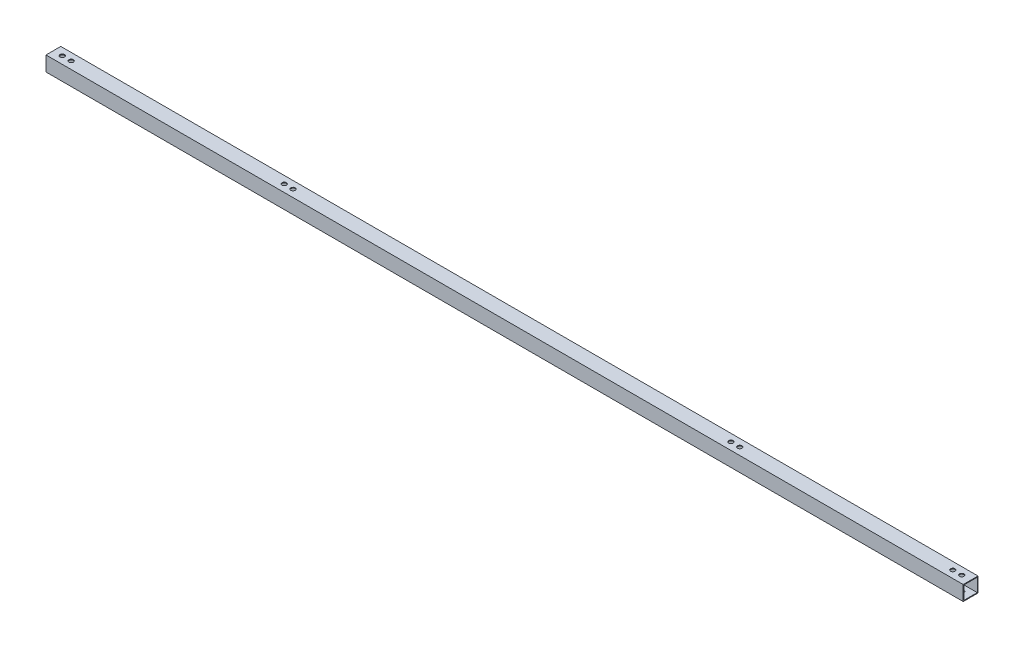
ISO-10303-21;
HEADER;
FILE_DESCRIPTION(('STEP AP214'),'2;1');
FILE_NAME('part.step','',(''),(''),'','','');
FILE_SCHEMA(('AUTOMOTIVE_DESIGN { 1 0 10303 214 1 1 1 1 }'));
ENDSEC;
DATA;
#1=APPLICATION_CONTEXT('core data for automotive mechanical design processes');
#2=APPLICATION_PROTOCOL_DEFINITION('international standard','automotive_design',2000,#1);
#3=PRODUCT_CONTEXT('',#1,'mechanical');
#4=PRODUCT('Part','Part','',(#3));
#5=PRODUCT_RELATED_PRODUCT_CATEGORY('part','',(#4));
#6=PRODUCT_DEFINITION_FORMATION('','',#4);
#7=PRODUCT_DEFINITION_CONTEXT('part definition',#1,'design');
#8=PRODUCT_DEFINITION('design','',#6,#7);
#9=PRODUCT_DEFINITION_SHAPE('','',#8);
#10=(LENGTH_UNIT() NAMED_UNIT(*) SI_UNIT(.MILLI.,.METRE.));
#11=(NAMED_UNIT(*) PLANE_ANGLE_UNIT() SI_UNIT($,.RADIAN.));
#12=(NAMED_UNIT(*) SI_UNIT($,.STERADIAN.) SOLID_ANGLE_UNIT());
#13=UNCERTAINTY_MEASURE_WITH_UNIT(LENGTH_MEASURE(1.E-05),#10,'distance_accuracy_value','');
#14=(GEOMETRIC_REPRESENTATION_CONTEXT(3) GLOBAL_UNCERTAINTY_ASSIGNED_CONTEXT((#13)) GLOBAL_UNIT_ASSIGNED_CONTEXT((#10,
#11,#12)) REPRESENTATION_CONTEXT('',''));
#15=CARTESIAN_POINT('',(0.,0.,0.));
#16=DIRECTION('',(0.,0.,1.));
#17=DIRECTION('',(1.,0.,0.));
#18=AXIS2_PLACEMENT_3D('',#15,#16,#17);
#19=CARTESIAN_POINT('',(1240.,0.,0.));
#20=DIRECTION('',(-1.,0.,0.));
#21=DIRECTION('',(0.,0.,1.));
#22=AXIS2_PLACEMENT_3D('',#19,#20,#21);
#23=PLANE('',#22);
#24=DIRECTION('',(0.,1.,0.));
#25=VECTOR('',#24,1.);
#26=CARTESIAN_POINT('',(1240.,-10.,-10.));
#27=LINE('',#26,#25);
#28=CARTESIAN_POINT('',(1240.,-10.,-10.));
#29=VERTEX_POINT('',#28);
#30=CARTESIAN_POINT('',(1240.,10.,-10.));
#31=VERTEX_POINT('',#30);
#32=EDGE_CURVE('E157',#29,#31,#27,.T.);
#33=ORIENTED_EDGE('',*,*,#32,.T.);
#34=DIRECTION('',(0.,0.,1.));
#35=VECTOR('',#34,1.);
#36=CARTESIAN_POINT('',(1240.,10.,10.));
#37=LINE('',#36,#35);
#38=CARTESIAN_POINT('',(1240.,10.,10.));
#39=VERTEX_POINT('',#38);
#40=EDGE_CURVE('E161',#31,#39,#37,.T.);
#41=ORIENTED_EDGE('',*,*,#40,.T.);
#42=DIRECTION('',(0.,-1.,0.));
#43=VECTOR('',#42,1.);
#44=CARTESIAN_POINT('',(1240.,-10.,10.));
#45=LINE('',#44,#43);
#46=CARTESIAN_POINT('',(1240.,-10.,10.));
#47=VERTEX_POINT('',#46);
#48=EDGE_CURVE('E165',#39,#47,#45,.T.);
#49=ORIENTED_EDGE('',*,*,#48,.T.);
#50=DIRECTION('',(0.,0.,-1.));
#51=VECTOR('',#50,1.);
#52=CARTESIAN_POINT('',(1240.,-10.,10.));
#53=LINE('',#52,#51);
#54=EDGE_CURVE('E168',#47,#29,#53,.T.);
#55=ORIENTED_EDGE('',*,*,#54,.T.);
#56=EDGE_LOOP('',(#33,#41,#49,#55));
#57=FACE_BOUND('',#56,.T.);
#58=DIRECTION('',(0.,-1.,0.));
#59=VECTOR('',#58,1.);
#60=CARTESIAN_POINT('',(1240.,-9.,9.));
#61=LINE('',#60,#59);
#62=CARTESIAN_POINT('',(1240.,9.,9.));
#63=VERTEX_POINT('',#62);
#64=CARTESIAN_POINT('',(1240.,-9.,9.));
#65=VERTEX_POINT('',#64);
#66=EDGE_CURVE('E107',#63,#65,#61,.T.);
#67=ORIENTED_EDGE('',*,*,#66,.F.);
#68=DIRECTION('',(0.,0.,1.));
#69=VECTOR('',#68,1.);
#70=CARTESIAN_POINT('',(1240.,9.,9.));
#71=LINE('',#70,#69);
#72=CARTESIAN_POINT('',(1240.,9.,-9.));
#73=VERTEX_POINT('',#72);
#74=EDGE_CURVE('E133',#73,#63,#71,.T.);
#75=ORIENTED_EDGE('',*,*,#74,.F.);
#76=DIRECTION('',(0.,1.,0.));
#77=VECTOR('',#76,1.);
#78=CARTESIAN_POINT('',(1240.,-9.,-9.));
#79=LINE('',#78,#77);
#80=CARTESIAN_POINT('',(1240.,-9.,-9.));
#81=VERTEX_POINT('',#80);
#82=EDGE_CURVE('E129',#81,#73,#79,.T.);
#83=ORIENTED_EDGE('',*,*,#82,.F.);
#84=DIRECTION('',(0.,0.,-1.));
#85=VECTOR('',#84,1.);
#86=CARTESIAN_POINT('',(1240.,-9.,9.));
#87=LINE('',#86,#85);
#88=EDGE_CURVE('E116',#65,#81,#87,.T.);
#89=ORIENTED_EDGE('',*,*,#88,.F.);
#90=EDGE_LOOP('',(#67,#75,#83,#89));
#91=FACE_BOUND('',#90,.T.);
#92=ADVANCED_FACE('F39',(#57,#91),#23,.F.);
#93=CARTESIAN_POINT('',(0.,0.,0.));
#94=DIRECTION('',(-1.,0.,0.));
#95=DIRECTION('',(0.,0.,1.));
#96=AXIS2_PLACEMENT_3D('',#93,#94,#95);
#97=PLANE('',#96);
#98=DIRECTION('',(0.,1.,0.));
#99=VECTOR('',#98,1.);
#100=CARTESIAN_POINT('',(0.,-10.,-10.));
#101=LINE('',#100,#99);
#102=CARTESIAN_POINT('',(0.,-10.,-10.));
#103=VERTEX_POINT('',#102);
#104=CARTESIAN_POINT('',(0.,10.,-10.));
#105=VERTEX_POINT('',#104);
#106=EDGE_CURVE('E125',#103,#105,#101,.T.);
#107=ORIENTED_EDGE('',*,*,#106,.F.);
#108=DIRECTION('',(0.,0.,-1.));
#109=VECTOR('',#108,1.);
#110=CARTESIAN_POINT('',(0.,-10.,10.));
#111=LINE('',#110,#109);
#112=CARTESIAN_POINT('',(0.,-10.,10.));
#113=VERTEX_POINT('',#112);
#114=EDGE_CURVE('E162',#113,#103,#111,.T.);
#115=ORIENTED_EDGE('',*,*,#114,.F.);
#116=DIRECTION('',(0.,-1.,0.));
#117=VECTOR('',#116,1.);
#118=CARTESIAN_POINT('',(0.,-10.,10.));
#119=LINE('',#118,#117);
#120=CARTESIAN_POINT('',(0.,10.,10.));
#121=VERTEX_POINT('',#120);
#122=EDGE_CURVE('E178',#121,#113,#119,.T.);
#123=ORIENTED_EDGE('',*,*,#122,.F.);
#124=DIRECTION('',(0.,0.,1.));
#125=VECTOR('',#124,1.);
#126=CARTESIAN_POINT('',(0.,10.,10.));
#127=LINE('',#126,#125);
#128=EDGE_CURVE('E175',#105,#121,#127,.T.);
#129=ORIENTED_EDGE('',*,*,#128,.F.);
#130=EDGE_LOOP('',(#107,#115,#123,#129));
#131=FACE_BOUND('',#130,.T.);
#132=DIRECTION('',(0.,0.,1.));
#133=VECTOR('',#132,1.);
#134=CARTESIAN_POINT('',(0.,9.,9.));
#135=LINE('',#134,#133);
#136=CARTESIAN_POINT('',(0.,9.,-9.));
#137=VERTEX_POINT('',#136);
#138=CARTESIAN_POINT('',(0.,9.,9.));
#139=VERTEX_POINT('',#138);
#140=EDGE_CURVE('E117',#137,#139,#135,.T.);
#141=ORIENTED_EDGE('',*,*,#140,.T.);
#142=DIRECTION('',(0.,-1.,0.));
#143=VECTOR('',#142,1.);
#144=CARTESIAN_POINT('',(0.,-9.,9.));
#145=LINE('',#144,#143);
#146=CARTESIAN_POINT('',(0.,-9.,9.));
#147=VERTEX_POINT('',#146);
#148=EDGE_CURVE('E65',#139,#147,#145,.T.);
#149=ORIENTED_EDGE('',*,*,#148,.T.);
#150=DIRECTION('',(0.,0.,-1.));
#151=VECTOR('',#150,1.);
#152=CARTESIAN_POINT('',(0.,-9.,9.));
#153=LINE('',#152,#151);
#154=CARTESIAN_POINT('',(0.,-9.,-9.));
#155=VERTEX_POINT('',#154);
#156=EDGE_CURVE('E123',#147,#155,#153,.T.);
#157=ORIENTED_EDGE('',*,*,#156,.T.);
#158=DIRECTION('',(0.,1.,0.));
#159=VECTOR('',#158,1.);
#160=CARTESIAN_POINT('',(0.,-9.,-9.));
#161=LINE('',#160,#159);
#162=EDGE_CURVE('E144',#155,#137,#161,.T.);
#163=ORIENTED_EDGE('',*,*,#162,.T.);
#164=EDGE_LOOP('',(#141,#149,#157,#163));
#165=FACE_BOUND('',#164,.T.);
#166=ADVANCED_FACE('F280',(#131,#165),#97,.T.);
#167=CARTESIAN_POINT('',(1240.,-10.,-10.));
#168=DIRECTION('',(0.,0.,1.));
#169=DIRECTION('',(1.,0.,0.));
#170=AXIS2_PLACEMENT_3D('',#167,#168,#169);
#171=PLANE('',#170);
#172=ORIENTED_EDGE('',*,*,#106,.T.);
#173=DIRECTION('',(-1.,0.,0.));
#174=VECTOR('',#173,1.);
#175=CARTESIAN_POINT('',(1240.,10.,-10.));
#176=LINE('',#175,#174);
#177=EDGE_CURVE('E11',#31,#105,#176,.T.);
#178=ORIENTED_EDGE('',*,*,#177,.F.);
#179=ORIENTED_EDGE('',*,*,#32,.F.);
#180=DIRECTION('',(-1.,0.,0.));
#181=VECTOR('',#180,1.);
#182=CARTESIAN_POINT('',(1240.,-10.,-10.));
#183=LINE('',#182,#181);
#184=EDGE_CURVE('E171',#29,#103,#183,.T.);
#185=ORIENTED_EDGE('',*,*,#184,.T.);
#186=EDGE_LOOP('',(#172,#178,#179,#185));
#187=FACE_BOUND('',#186,.T.);
#188=ADVANCED_FACE('F41',(#187),#171,.F.);
#189=CARTESIAN_POINT('',(1240.,10.,10.));
#190=DIRECTION('',(0.,-1.,0.));
#191=DIRECTION('',(0.,0.,-1.));
#192=AXIS2_PLACEMENT_3D('',#189,#190,#191);
#193=PLANE('',#192);
#194=CARTESIAN_POINT('',(12.,10.,0.));
#195=DIRECTION('',(0.,1.,0.));
#196=DIRECTION('',(0.,0.,1.));
#197=AXIS2_PLACEMENT_3D('',#194,#195,#196);
#198=CIRCLE('',#197,3.);
#199=CARTESIAN_POINT('',(12.,10.,3.));
#200=VERTEX_POINT('',#199);
#201=EDGE_CURVE('E198',#200,#200,#198,.T.);
#202=ORIENTED_EDGE('',*,*,#201,.F.);
#203=EDGE_LOOP('',(#202));
#204=FACE_BOUND('',#203,.T.);
#205=CARTESIAN_POINT('',(928.,10.,0.));
#206=DIRECTION('',(0.,1.,0.));
#207=DIRECTION('',(0.,0.,-1.));
#208=AXIS2_PLACEMENT_3D('',#205,#206,#207);
#209=CIRCLE('',#208,2.99999999999994);
#210=CARTESIAN_POINT('',(928.,10.,-2.99999999999994));
#211=VERTEX_POINT('',#210);
#212=EDGE_CURVE('E309',#211,#211,#209,.T.);
#213=ORIENTED_EDGE('',*,*,#212,.F.);
#214=EDGE_LOOP('',(#213));
#215=FACE_BOUND('',#214,.T.);
#216=CARTESIAN_POINT('',(916.,10.,0.));
#217=DIRECTION('',(0.,1.,0.));
#218=DIRECTION('',(0.,0.,-1.));
#219=AXIS2_PLACEMENT_3D('',#216,#217,#218);
#220=CIRCLE('',#219,2.99999999999994);
#221=CARTESIAN_POINT('',(916.,10.,-2.99999999999994));
#222=VERTEX_POINT('',#221);
#223=EDGE_CURVE('E313',#222,#222,#220,.T.);
#224=ORIENTED_EDGE('',*,*,#223,.F.);
#225=EDGE_LOOP('',(#224));
#226=FACE_BOUND('',#225,.T.);
#227=CARTESIAN_POINT('',(324.,10.,0.));
#228=DIRECTION('',(0.,1.,0.));
#229=DIRECTION('',(0.,0.,1.));
#230=AXIS2_PLACEMENT_3D('',#227,#228,#229);
#231=CIRCLE('',#230,2.99999999999999);
#232=CARTESIAN_POINT('',(324.,10.,2.99999999999999));
#233=VERTEX_POINT('',#232);
#234=EDGE_CURVE('E317',#233,#233,#231,.T.);
#235=ORIENTED_EDGE('',*,*,#234,.F.);
#236=EDGE_LOOP('',(#235));
#237=FACE_BOUND('',#236,.T.);
#238=CARTESIAN_POINT('',(24.,10.,0.));
#239=DIRECTION('',(0.,1.,0.));
#240=DIRECTION('',(0.,0.,1.));
#241=AXIS2_PLACEMENT_3D('',#238,#239,#240);
#242=CIRCLE('',#241,3.);
#243=CARTESIAN_POINT('',(24.,10.,3.));
#244=VERTEX_POINT('',#243);
#245=EDGE_CURVE('E321',#244,#244,#242,.T.);
#246=ORIENTED_EDGE('',*,*,#245,.F.);
#247=EDGE_LOOP('',(#246));
#248=FACE_BOUND('',#247,.T.);
#249=CARTESIAN_POINT('',(1216.,10.,0.));
#250=DIRECTION('',(0.,1.,0.));
#251=DIRECTION('',(0.,0.,-1.));
#252=AXIS2_PLACEMENT_3D('',#249,#250,#251);
#253=CIRCLE('',#252,2.99999999999994);
#254=CARTESIAN_POINT('',(1216.,10.,-2.99999999999994));
#255=VERTEX_POINT('',#254);
#256=EDGE_CURVE('E325',#255,#255,#253,.T.);
#257=ORIENTED_EDGE('',*,*,#256,.F.);
#258=EDGE_LOOP('',(#257));
#259=FACE_BOUND('',#258,.T.);
#260=CARTESIAN_POINT('',(1228.,10.,0.));
#261=DIRECTION('',(0.,1.,0.));
#262=DIRECTION('',(0.,0.,-1.));
#263=AXIS2_PLACEMENT_3D('',#260,#261,#262);
#264=CIRCLE('',#263,2.99999999999994);
#265=CARTESIAN_POINT('',(1228.,10.,-2.99999999999994));
#266=VERTEX_POINT('',#265);
#267=EDGE_CURVE('E329',#266,#266,#264,.T.);
#268=ORIENTED_EDGE('',*,*,#267,.F.);
#269=EDGE_LOOP('',(#268));
#270=FACE_BOUND('',#269,.T.);
#271=CARTESIAN_POINT('',(312.,10.,0.));
#272=DIRECTION('',(0.,1.,0.));
#273=DIRECTION('',(0.,0.,1.));
#274=AXIS2_PLACEMENT_3D('',#271,#272,#273);
#275=CIRCLE('',#274,2.99999999999999);
#276=CARTESIAN_POINT('',(312.,10.,2.99999999999999));
#277=VERTEX_POINT('',#276);
#278=EDGE_CURVE('E333',#277,#277,#275,.T.);
#279=ORIENTED_EDGE('',*,*,#278,.F.);
#280=EDGE_LOOP('',(#279));
#281=FACE_BOUND('',#280,.T.);
#282=ORIENTED_EDGE('',*,*,#128,.T.);
#283=DIRECTION('',(-1.,0.,0.));
#284=VECTOR('',#283,1.);
#285=CARTESIAN_POINT('',(1240.,10.,10.));
#286=LINE('',#285,#284);
#287=EDGE_CURVE('E49',#39,#121,#286,.T.);
#288=ORIENTED_EDGE('',*,*,#287,.F.);
#289=ORIENTED_EDGE('',*,*,#40,.F.);
#290=ORIENTED_EDGE('',*,*,#177,.T.);
#291=EDGE_LOOP('',(#282,#288,#289,#290));
#292=FACE_BOUND('',#291,.T.);
#293=ADVANCED_FACE('F295',(#204,#215,#226,#237,#248,#259,#270,#281,#292),#193,.F.);
#294=CARTESIAN_POINT('',(1240.,-10.,10.));
#295=DIRECTION('',(0.,0.,-1.));
#296=DIRECTION('',(-1.,0.,0.));
#297=AXIS2_PLACEMENT_3D('',#294,#295,#296);
#298=PLANE('',#297);
#299=ORIENTED_EDGE('',*,*,#122,.T.);
#300=DIRECTION('',(-1.,0.,0.));
#301=VECTOR('',#300,1.);
#302=CARTESIAN_POINT('',(1240.,-10.,10.));
#303=LINE('',#302,#301);
#304=EDGE_CURVE('E186',#47,#113,#303,.T.);
#305=ORIENTED_EDGE('',*,*,#304,.F.);
#306=ORIENTED_EDGE('',*,*,#48,.F.);
#307=ORIENTED_EDGE('',*,*,#287,.T.);
#308=EDGE_LOOP('',(#299,#305,#306,#307));
#309=FACE_BOUND('',#308,.T.);
#310=ADVANCED_FACE('F293',(#309),#298,.F.);
#311=CARTESIAN_POINT('',(1240.,-10.,10.));
#312=DIRECTION('',(0.,1.,0.));
#313=DIRECTION('',(0.,0.,1.));
#314=AXIS2_PLACEMENT_3D('',#311,#312,#313);
#315=PLANE('',#314);
#316=CARTESIAN_POINT('',(12.,-10.,0.));
#317=DIRECTION('',(0.,1.,0.));
#318=DIRECTION('',(0.,0.,1.));
#319=AXIS2_PLACEMENT_3D('',#316,#317,#318);
#320=CIRCLE('',#319,3.);
#321=CARTESIAN_POINT('',(12.,-10.,3.));
#322=VERTEX_POINT('',#321);
#323=EDGE_CURVE('E141',#322,#322,#320,.T.);
#324=ORIENTED_EDGE('',*,*,#323,.T.);
#325=EDGE_LOOP('',(#324));
#326=FACE_BOUND('',#325,.T.);
#327=CARTESIAN_POINT('',(928.,-10.,0.));
#328=DIRECTION('',(0.,1.,0.));
#329=DIRECTION('',(0.,0.,1.));
#330=AXIS2_PLACEMENT_3D('',#327,#328,#329);
#331=CIRCLE('',#330,2.99999999999994);
#332=CARTESIAN_POINT('',(928.,-10.,2.99999999999994));
#333=VERTEX_POINT('',#332);
#334=EDGE_CURVE('E238',#333,#333,#331,.T.);
#335=ORIENTED_EDGE('',*,*,#334,.T.);
#336=EDGE_LOOP('',(#335));
#337=FACE_BOUND('',#336,.T.);
#338=CARTESIAN_POINT('',(916.,-10.,0.));
#339=DIRECTION('',(0.,1.,0.));
#340=DIRECTION('',(0.,0.,1.));
#341=AXIS2_PLACEMENT_3D('',#338,#339,#340);
#342=CIRCLE('',#341,2.99999999999994);
#343=CARTESIAN_POINT('',(916.,-10.,2.99999999999994));
#344=VERTEX_POINT('',#343);
#345=EDGE_CURVE('E232',#344,#344,#342,.T.);
#346=ORIENTED_EDGE('',*,*,#345,.T.);
#347=EDGE_LOOP('',(#346));
#348=FACE_BOUND('',#347,.T.);
#349=CARTESIAN_POINT('',(324.,-10.,0.));
#350=DIRECTION('',(0.,1.,0.));
#351=DIRECTION('',(0.,0.,1.));
#352=AXIS2_PLACEMENT_3D('',#349,#350,#351);
#353=CIRCLE('',#352,2.99999999999999);
#354=CARTESIAN_POINT('',(324.,-10.,2.99999999999999));
#355=VERTEX_POINT('',#354);
#356=EDGE_CURVE('E227',#355,#355,#353,.T.);
#357=ORIENTED_EDGE('',*,*,#356,.T.);
#358=EDGE_LOOP('',(#357));
#359=FACE_BOUND('',#358,.T.);
#360=CARTESIAN_POINT('',(24.,-10.,0.));
#361=DIRECTION('',(0.,1.,0.));
#362=DIRECTION('',(0.,0.,1.));
#363=AXIS2_PLACEMENT_3D('',#360,#361,#362);
#364=CIRCLE('',#363,3.);
#365=CARTESIAN_POINT('',(24.,-10.,3.));
#366=VERTEX_POINT('',#365);
#367=EDGE_CURVE('E222',#366,#366,#364,.T.);
#368=ORIENTED_EDGE('',*,*,#367,.T.);
#369=EDGE_LOOP('',(#368));
#370=FACE_BOUND('',#369,.T.);
#371=CARTESIAN_POINT('',(1216.,-10.,0.));
#372=DIRECTION('',(0.,1.,0.));
#373=DIRECTION('',(0.,0.,1.));
#374=AXIS2_PLACEMENT_3D('',#371,#372,#373);
#375=CIRCLE('',#374,2.99999999999994);
#376=CARTESIAN_POINT('',(1216.,-10.,2.99999999999994));
#377=VERTEX_POINT('',#376);
#378=EDGE_CURVE('E216',#377,#377,#375,.T.);
#379=ORIENTED_EDGE('',*,*,#378,.T.);
#380=EDGE_LOOP('',(#379));
#381=FACE_BOUND('',#380,.T.);
#382=CARTESIAN_POINT('',(1228.,-10.,0.));
#383=DIRECTION('',(0.,1.,0.));
#384=DIRECTION('',(0.,0.,1.));
#385=AXIS2_PLACEMENT_3D('',#382,#383,#384);
#386=CIRCLE('',#385,2.99999999999994);
#387=CARTESIAN_POINT('',(1228.,-10.,2.99999999999994));
#388=VERTEX_POINT('',#387);
#389=EDGE_CURVE('E210',#388,#388,#386,.T.);
#390=ORIENTED_EDGE('',*,*,#389,.T.);
#391=EDGE_LOOP('',(#390));
#392=FACE_BOUND('',#391,.T.);
#393=CARTESIAN_POINT('',(312.,-10.,0.));
#394=DIRECTION('',(0.,1.,0.));
#395=DIRECTION('',(0.,0.,1.));
#396=AXIS2_PLACEMENT_3D('',#393,#394,#395);
#397=CIRCLE('',#396,2.99999999999999);
#398=CARTESIAN_POINT('',(312.,-10.,2.99999999999999));
#399=VERTEX_POINT('',#398);
#400=EDGE_CURVE('E204',#399,#399,#397,.T.);
#401=ORIENTED_EDGE('',*,*,#400,.T.);
#402=EDGE_LOOP('',(#401));
#403=FACE_BOUND('',#402,.T.);
#404=ORIENTED_EDGE('',*,*,#114,.T.);
#405=ORIENTED_EDGE('',*,*,#184,.F.);
#406=ORIENTED_EDGE('',*,*,#54,.F.);
#407=ORIENTED_EDGE('',*,*,#304,.T.);
#408=EDGE_LOOP('',(#404,#405,#406,#407));
#409=FACE_BOUND('',#408,.T.);
#410=ADVANCED_FACE('F259',(#326,#337,#348,#359,#370,#381,#392,#403,#409),#315,.F.);
#411=CARTESIAN_POINT('',(1240.,-9.,9.));
#412=DIRECTION('',(0.,0.,-1.));
#413=DIRECTION('',(-1.,0.,0.));
#414=AXIS2_PLACEMENT_3D('',#411,#412,#413);
#415=PLANE('',#414);
#416=ORIENTED_EDGE('',*,*,#148,.F.);
#417=DIRECTION('',(-1.,0.,0.));
#418=VECTOR('',#417,1.);
#419=CARTESIAN_POINT('',(1240.,9.,9.));
#420=LINE('',#419,#418);
#421=EDGE_CURVE('E111',#63,#139,#420,.T.);
#422=ORIENTED_EDGE('',*,*,#421,.F.);
#423=ORIENTED_EDGE('',*,*,#66,.T.);
#424=DIRECTION('',(-1.,0.,0.));
#425=VECTOR('',#424,1.);
#426=CARTESIAN_POINT('',(1240.,-9.,9.));
#427=LINE('',#426,#425);
#428=EDGE_CURVE('E110',#65,#147,#427,.T.);
#429=ORIENTED_EDGE('',*,*,#428,.T.);
#430=EDGE_LOOP('',(#416,#422,#423,#429));
#431=FACE_BOUND('',#430,.T.);
#432=ADVANCED_FACE('F109',(#431),#415,.T.);
#433=CARTESIAN_POINT('',(1240.,-9.,9.));
#434=DIRECTION('',(0.,1.,0.));
#435=DIRECTION('',(0.,0.,1.));
#436=AXIS2_PLACEMENT_3D('',#433,#434,#435);
#437=PLANE('',#436);
#438=CARTESIAN_POINT('',(12.,-8.9999999999999,0.));
#439=DIRECTION('',(0.,1.,0.));
#440=DIRECTION('',(0.,0.,1.));
#441=AXIS2_PLACEMENT_3D('',#438,#439,#440);
#442=CIRCLE('',#441,3.);
#443=CARTESIAN_POINT('',(12.,-8.9999999999999,3.));
#444=VERTEX_POINT('',#443);
#445=EDGE_CURVE('E252',#444,#444,#442,.T.);
#446=ORIENTED_EDGE('',*,*,#445,.F.);
#447=EDGE_LOOP('',(#446));
#448=FACE_BOUND('',#447,.T.);
#449=CARTESIAN_POINT('',(928.,-8.9999999999999,0.));
#450=DIRECTION('',(0.,1.,0.));
#451=DIRECTION('',(0.,0.,1.));
#452=AXIS2_PLACEMENT_3D('',#449,#450,#451);
#453=CIRCLE('',#452,2.99999999999994);
#454=CARTESIAN_POINT('',(928.,-8.9999999999999,2.99999999999994));
#455=VERTEX_POINT('',#454);
#456=EDGE_CURVE('E231',#455,#455,#453,.T.);
#457=ORIENTED_EDGE('',*,*,#456,.F.);
#458=EDGE_LOOP('',(#457));
#459=FACE_BOUND('',#458,.T.);
#460=CARTESIAN_POINT('',(916.,-8.9999999999999,0.));
#461=DIRECTION('',(0.,1.,0.));
#462=DIRECTION('',(0.,0.,1.));
#463=AXIS2_PLACEMENT_3D('',#460,#461,#462);
#464=CIRCLE('',#463,2.99999999999994);
#465=CARTESIAN_POINT('',(916.,-8.9999999999999,2.99999999999994));
#466=VERTEX_POINT('',#465);
#467=EDGE_CURVE('E226',#466,#466,#464,.T.);
#468=ORIENTED_EDGE('',*,*,#467,.F.);
#469=EDGE_LOOP('',(#468));
#470=FACE_BOUND('',#469,.T.);
#471=CARTESIAN_POINT('',(324.,-8.9999999999999,0.));
#472=DIRECTION('',(0.,1.,0.));
#473=DIRECTION('',(0.,0.,1.));
#474=AXIS2_PLACEMENT_3D('',#471,#472,#473);
#475=CIRCLE('',#474,2.99999999999999);
#476=CARTESIAN_POINT('',(324.,-8.9999999999999,2.99999999999999));
#477=VERTEX_POINT('',#476);
#478=EDGE_CURVE('E221',#477,#477,#475,.T.);
#479=ORIENTED_EDGE('',*,*,#478,.F.);
#480=EDGE_LOOP('',(#479));
#481=FACE_BOUND('',#480,.T.);
#482=CARTESIAN_POINT('',(24.,-8.9999999999999,0.));
#483=DIRECTION('',(0.,1.,0.));
#484=DIRECTION('',(0.,0.,1.));
#485=AXIS2_PLACEMENT_3D('',#482,#483,#484);
#486=CIRCLE('',#485,3.);
#487=CARTESIAN_POINT('',(24.,-8.9999999999999,3.));
#488=VERTEX_POINT('',#487);
#489=EDGE_CURVE('E215',#488,#488,#486,.T.);
#490=ORIENTED_EDGE('',*,*,#489,.F.);
#491=EDGE_LOOP('',(#490));
#492=FACE_BOUND('',#491,.T.);
#493=CARTESIAN_POINT('',(1216.,-8.9999999999999,0.));
#494=DIRECTION('',(0.,1.,0.));
#495=DIRECTION('',(0.,0.,1.));
#496=AXIS2_PLACEMENT_3D('',#493,#494,#495);
#497=CIRCLE('',#496,2.99999999999994);
#498=CARTESIAN_POINT('',(1216.,-8.9999999999999,2.99999999999994));
#499=VERTEX_POINT('',#498);
#500=EDGE_CURVE('E209',#499,#499,#497,.T.);
#501=ORIENTED_EDGE('',*,*,#500,.F.);
#502=EDGE_LOOP('',(#501));
#503=FACE_BOUND('',#502,.T.);
#504=CARTESIAN_POINT('',(1228.,-8.9999999999999,0.));
#505=DIRECTION('',(0.,1.,0.));
#506=DIRECTION('',(0.,0.,1.));
#507=AXIS2_PLACEMENT_3D('',#504,#505,#506);
#508=CIRCLE('',#507,2.99999999999994);
#509=CARTESIAN_POINT('',(1228.,-8.9999999999999,2.99999999999994));
#510=VERTEX_POINT('',#509);
#511=EDGE_CURVE('E203',#510,#510,#508,.T.);
#512=ORIENTED_EDGE('',*,*,#511,.F.);
#513=EDGE_LOOP('',(#512));
#514=FACE_BOUND('',#513,.T.);
#515=CARTESIAN_POINT('',(312.,-8.9999999999999,0.));
#516=DIRECTION('',(0.,1.,0.));
#517=DIRECTION('',(0.,0.,1.));
#518=AXIS2_PLACEMENT_3D('',#515,#516,#517);
#519=CIRCLE('',#518,2.99999999999999);
#520=CARTESIAN_POINT('',(312.,-8.9999999999999,2.99999999999999));
#521=VERTEX_POINT('',#520);
#522=EDGE_CURVE('E197',#521,#521,#519,.T.);
#523=ORIENTED_EDGE('',*,*,#522,.F.);
#524=EDGE_LOOP('',(#523));
#525=FACE_BOUND('',#524,.T.);
#526=ORIENTED_EDGE('',*,*,#156,.F.);
#527=ORIENTED_EDGE('',*,*,#428,.F.);
#528=ORIENTED_EDGE('',*,*,#88,.T.);
#529=DIRECTION('',(-1.,0.,0.));
#530=VECTOR('',#529,1.);
#531=CARTESIAN_POINT('',(1240.,-9.,-9.));
#532=LINE('',#531,#530);
#533=EDGE_CURVE('E126',#81,#155,#532,.T.);
#534=ORIENTED_EDGE('',*,*,#533,.T.);
#535=EDGE_LOOP('',(#526,#527,#528,#534));
#536=FACE_BOUND('',#535,.T.);
#537=ADVANCED_FACE('F120',(#448,#459,#470,#481,#492,#503,#514,#525,#536),#437,.T.);
#538=CARTESIAN_POINT('',(1240.,-9.,-9.));
#539=DIRECTION('',(0.,0.,1.));
#540=DIRECTION('',(1.,0.,0.));
#541=AXIS2_PLACEMENT_3D('',#538,#539,#540);
#542=PLANE('',#541);
#543=ORIENTED_EDGE('',*,*,#162,.F.);
#544=ORIENTED_EDGE('',*,*,#533,.F.);
#545=ORIENTED_EDGE('',*,*,#82,.T.);
#546=DIRECTION('',(-1.,0.,0.));
#547=VECTOR('',#546,1.);
#548=CARTESIAN_POINT('',(1240.,9.,-9.));
#549=LINE('',#548,#547);
#550=EDGE_CURVE('E57',#73,#137,#549,.T.);
#551=ORIENTED_EDGE('',*,*,#550,.T.);
#552=EDGE_LOOP('',(#543,#544,#545,#551));
#553=FACE_BOUND('',#552,.T.);
#554=ADVANCED_FACE('F350',(#553),#542,.T.);
#555=CARTESIAN_POINT('',(1240.,9.,9.));
#556=DIRECTION('',(0.,-1.,0.));
#557=DIRECTION('',(0.,0.,-1.));
#558=AXIS2_PLACEMENT_3D('',#555,#556,#557);
#559=PLANE('',#558);
#560=CARTESIAN_POINT('',(12.,8.9999999999999,0.));
#561=DIRECTION('',(0.,-1.,0.));
#562=DIRECTION('',(0.,0.,-1.));
#563=AXIS2_PLACEMENT_3D('',#560,#561,#562);
#564=CIRCLE('',#563,3.);
#565=CARTESIAN_POINT('',(12.,8.9999999999999,-3.));
#566=VERTEX_POINT('',#565);
#567=EDGE_CURVE('E43',#566,#566,#564,.T.);
#568=ORIENTED_EDGE('',*,*,#567,.F.);
#569=EDGE_LOOP('',(#568));
#570=FACE_BOUND('',#569,.T.);
#571=CARTESIAN_POINT('',(928.,8.9999999999999,0.));
#572=DIRECTION('',(0.,-1.,0.));
#573=DIRECTION('',(0.,0.,-1.));
#574=AXIS2_PLACEMENT_3D('',#571,#572,#573);
#575=CIRCLE('',#574,2.99999999999994);
#576=CARTESIAN_POINT('',(928.,8.9999999999999,-2.99999999999994));
#577=VERTEX_POINT('',#576);
#578=EDGE_CURVE('E228',#577,#577,#575,.T.);
#579=ORIENTED_EDGE('',*,*,#578,.F.);
#580=EDGE_LOOP('',(#579));
#581=FACE_BOUND('',#580,.T.);
#582=CARTESIAN_POINT('',(916.,8.9999999999999,0.));
#583=DIRECTION('',(0.,-1.,0.));
#584=DIRECTION('',(0.,0.,-1.));
#585=AXIS2_PLACEMENT_3D('',#582,#583,#584);
#586=CIRCLE('',#585,2.99999999999994);
#587=CARTESIAN_POINT('',(916.,8.9999999999999,-2.99999999999994));
#588=VERTEX_POINT('',#587);
#589=EDGE_CURVE('E223',#588,#588,#586,.T.);
#590=ORIENTED_EDGE('',*,*,#589,.F.);
#591=EDGE_LOOP('',(#590));
#592=FACE_BOUND('',#591,.T.);
#593=CARTESIAN_POINT('',(324.,8.9999999999999,0.));
#594=DIRECTION('',(0.,-1.,0.));
#595=DIRECTION('',(0.,0.,-1.));
#596=AXIS2_PLACEMENT_3D('',#593,#594,#595);
#597=CIRCLE('',#596,2.99999999999999);
#598=CARTESIAN_POINT('',(324.,8.9999999999999,-2.99999999999999));
#599=VERTEX_POINT('',#598);
#600=EDGE_CURVE('E217',#599,#599,#597,.T.);
#601=ORIENTED_EDGE('',*,*,#600,.F.);
#602=EDGE_LOOP('',(#601));
#603=FACE_BOUND('',#602,.T.);
#604=CARTESIAN_POINT('',(24.,8.9999999999999,0.));
#605=DIRECTION('',(0.,-1.,0.));
#606=DIRECTION('',(0.,0.,-1.));
#607=AXIS2_PLACEMENT_3D('',#604,#605,#606);
#608=CIRCLE('',#607,3.);
#609=CARTESIAN_POINT('',(24.,8.9999999999999,-3.));
#610=VERTEX_POINT('',#609);
#611=EDGE_CURVE('E211',#610,#610,#608,.T.);
#612=ORIENTED_EDGE('',*,*,#611,.F.);
#613=EDGE_LOOP('',(#612));
#614=FACE_BOUND('',#613,.T.);
#615=CARTESIAN_POINT('',(1216.,8.9999999999999,0.));
#616=DIRECTION('',(0.,-1.,0.));
#617=DIRECTION('',(0.,0.,-1.));
#618=AXIS2_PLACEMENT_3D('',#615,#616,#617);
#619=CIRCLE('',#618,2.99999999999994);
#620=CARTESIAN_POINT('',(1216.,8.9999999999999,-2.99999999999994));
#621=VERTEX_POINT('',#620);
#622=EDGE_CURVE('E205',#621,#621,#619,.T.);
#623=ORIENTED_EDGE('',*,*,#622,.F.);
#624=EDGE_LOOP('',(#623));
#625=FACE_BOUND('',#624,.T.);
#626=CARTESIAN_POINT('',(1228.,8.9999999999999,0.));
#627=DIRECTION('',(0.,-1.,0.));
#628=DIRECTION('',(0.,0.,-1.));
#629=AXIS2_PLACEMENT_3D('',#626,#627,#628);
#630=CIRCLE('',#629,2.99999999999994);
#631=CARTESIAN_POINT('',(1228.,8.9999999999999,-2.99999999999994));
#632=VERTEX_POINT('',#631);
#633=EDGE_CURVE('E199',#632,#632,#630,.T.);
#634=ORIENTED_EDGE('',*,*,#633,.F.);
#635=EDGE_LOOP('',(#634));
#636=FACE_BOUND('',#635,.T.);
#637=CARTESIAN_POINT('',(312.,8.9999999999999,0.));
#638=DIRECTION('',(0.,-1.,0.));
#639=DIRECTION('',(0.,0.,-1.));
#640=AXIS2_PLACEMENT_3D('',#637,#638,#639);
#641=CIRCLE('',#640,2.99999999999999);
#642=CARTESIAN_POINT('',(312.,8.9999999999999,-2.99999999999999));
#643=VERTEX_POINT('',#642);
#644=EDGE_CURVE('E193',#643,#643,#641,.T.);
#645=ORIENTED_EDGE('',*,*,#644,.F.);
#646=EDGE_LOOP('',(#645));
#647=FACE_BOUND('',#646,.T.);
#648=ORIENTED_EDGE('',*,*,#140,.F.);
#649=ORIENTED_EDGE('',*,*,#550,.F.);
#650=ORIENTED_EDGE('',*,*,#74,.T.);
#651=ORIENTED_EDGE('',*,*,#421,.T.);
#652=EDGE_LOOP('',(#648,#649,#650,#651));
#653=FACE_BOUND('',#652,.T.);
#654=ADVANCED_FACE('F347',(#570,#581,#592,#603,#614,#625,#636,#647,#653),#559,.T.);
#655=CARTESIAN_POINT('',(312.,-1230.,0.));
#656=DIRECTION('',(0.,1.,0.));
#657=DIRECTION('',(0.,0.,1.));
#658=AXIS2_PLACEMENT_3D('',#655,#656,#657);
#659=CYLINDRICAL_SURFACE('',#658,2.99999999999999);
#660=ORIENTED_EDGE('',*,*,#644,.T.);
#661=EDGE_LOOP('',(#660));
#662=FACE_BOUND('',#661,.T.);
#663=ORIENTED_EDGE('',*,*,#278,.T.);
#664=EDGE_LOOP('',(#663));
#665=FACE_BOUND('',#664,.T.);
#666=ADVANCED_FACE('F349',(#662,#665),#659,.F.);
#667=CARTESIAN_POINT('',(1228.,-1230.,0.));
#668=DIRECTION('',(0.,1.,0.));
#669=DIRECTION('',(0.,0.,1.));
#670=AXIS2_PLACEMENT_3D('',#667,#668,#669);
#671=CYLINDRICAL_SURFACE('',#670,2.99999999999994);
#672=ORIENTED_EDGE('',*,*,#633,.T.);
#673=EDGE_LOOP('',(#672));
#674=FACE_BOUND('',#673,.T.);
#675=ORIENTED_EDGE('',*,*,#267,.T.);
#676=EDGE_LOOP('',(#675));
#677=FACE_BOUND('',#676,.T.);
#678=ADVANCED_FACE('F357',(#674,#677),#671,.F.);
#679=CARTESIAN_POINT('',(1216.,-1230.,0.));
#680=DIRECTION('',(0.,1.,0.));
#681=DIRECTION('',(0.,0.,1.));
#682=AXIS2_PLACEMENT_3D('',#679,#680,#681);
#683=CYLINDRICAL_SURFACE('',#682,2.99999999999994);
#684=ORIENTED_EDGE('',*,*,#622,.T.);
#685=EDGE_LOOP('',(#684));
#686=FACE_BOUND('',#685,.T.);
#687=ORIENTED_EDGE('',*,*,#256,.T.);
#688=EDGE_LOOP('',(#687));
#689=FACE_BOUND('',#688,.T.);
#690=ADVANCED_FACE('F365',(#686,#689),#683,.F.);
#691=CARTESIAN_POINT('',(24.,-1230.,0.));
#692=DIRECTION('',(0.,1.,0.));
#693=DIRECTION('',(0.,0.,1.));
#694=AXIS2_PLACEMENT_3D('',#691,#692,#693);
#695=CYLINDRICAL_SURFACE('',#694,3.);
#696=ORIENTED_EDGE('',*,*,#611,.T.);
#697=EDGE_LOOP('',(#696));
#698=FACE_BOUND('',#697,.T.);
#699=ORIENTED_EDGE('',*,*,#245,.T.);
#700=EDGE_LOOP('',(#699));
#701=FACE_BOUND('',#700,.T.);
#702=ADVANCED_FACE('F437',(#698,#701),#695,.F.);
#703=CARTESIAN_POINT('',(324.,-1230.,0.));
#704=DIRECTION('',(0.,1.,0.));
#705=DIRECTION('',(0.,0.,1.));
#706=AXIS2_PLACEMENT_3D('',#703,#704,#705);
#707=CYLINDRICAL_SURFACE('',#706,2.99999999999999);
#708=ORIENTED_EDGE('',*,*,#600,.T.);
#709=EDGE_LOOP('',(#708));
#710=FACE_BOUND('',#709,.T.);
#711=ORIENTED_EDGE('',*,*,#234,.T.);
#712=EDGE_LOOP('',(#711));
#713=FACE_BOUND('',#712,.T.);
#714=ADVANCED_FACE('F427',(#710,#713),#707,.F.);
#715=CARTESIAN_POINT('',(916.,-1230.,0.));
#716=DIRECTION('',(0.,1.,0.));
#717=DIRECTION('',(0.,0.,1.));
#718=AXIS2_PLACEMENT_3D('',#715,#716,#717);
#719=CYLINDRICAL_SURFACE('',#718,2.99999999999994);
#720=ORIENTED_EDGE('',*,*,#589,.T.);
#721=EDGE_LOOP('',(#720));
#722=FACE_BOUND('',#721,.T.);
#723=ORIENTED_EDGE('',*,*,#223,.T.);
#724=EDGE_LOOP('',(#723));
#725=FACE_BOUND('',#724,.T.);
#726=ADVANCED_FACE('F434',(#722,#725),#719,.F.);
#727=CARTESIAN_POINT('',(928.,-1230.,0.));
#728=DIRECTION('',(0.,1.,0.));
#729=DIRECTION('',(0.,0.,1.));
#730=AXIS2_PLACEMENT_3D('',#727,#728,#729);
#731=CYLINDRICAL_SURFACE('',#730,2.99999999999994);
#732=ORIENTED_EDGE('',*,*,#578,.T.);
#733=EDGE_LOOP('',(#732));
#734=FACE_BOUND('',#733,.T.);
#735=ORIENTED_EDGE('',*,*,#212,.T.);
#736=EDGE_LOOP('',(#735));
#737=FACE_BOUND('',#736,.T.);
#738=ADVANCED_FACE('F274',(#734,#737),#731,.F.);
#739=CARTESIAN_POINT('',(12.,-1230.,0.));
#740=DIRECTION('',(0.,1.,0.));
#741=DIRECTION('',(0.,0.,1.));
#742=AXIS2_PLACEMENT_3D('',#739,#740,#741);
#743=CYLINDRICAL_SURFACE('',#742,3.);
#744=ORIENTED_EDGE('',*,*,#567,.T.);
#745=EDGE_LOOP('',(#744));
#746=FACE_BOUND('',#745,.T.);
#747=ORIENTED_EDGE('',*,*,#201,.T.);
#748=EDGE_LOOP('',(#747));
#749=FACE_BOUND('',#748,.T.);
#750=ADVANCED_FACE('F267',(#746,#749),#743,.F.);
#751=ORIENTED_EDGE('',*,*,#522,.T.);
#752=EDGE_LOOP('',(#751));
#753=FACE_BOUND('',#752,.T.);
#754=ORIENTED_EDGE('',*,*,#400,.F.);
#755=EDGE_LOOP('',(#754));
#756=FACE_BOUND('',#755,.T.);
#757=ADVANCED_FACE('F277',(#753,#756),#659,.F.);
#758=ORIENTED_EDGE('',*,*,#511,.T.);
#759=EDGE_LOOP('',(#758));
#760=FACE_BOUND('',#759,.T.);
#761=ORIENTED_EDGE('',*,*,#389,.F.);
#762=EDGE_LOOP('',(#761));
#763=FACE_BOUND('',#762,.T.);
#764=ADVANCED_FACE('F471',(#760,#763),#671,.F.);
#765=ORIENTED_EDGE('',*,*,#500,.T.);
#766=EDGE_LOOP('',(#765));
#767=FACE_BOUND('',#766,.T.);
#768=ORIENTED_EDGE('',*,*,#378,.F.);
#769=EDGE_LOOP('',(#768));
#770=FACE_BOUND('',#769,.T.);
#771=ADVANCED_FACE('F435',(#767,#770),#683,.F.);
#772=ORIENTED_EDGE('',*,*,#489,.T.);
#773=EDGE_LOOP('',(#772));
#774=FACE_BOUND('',#773,.T.);
#775=ORIENTED_EDGE('',*,*,#367,.F.);
#776=EDGE_LOOP('',(#775));
#777=FACE_BOUND('',#776,.T.);
#778=ADVANCED_FACE('F425',(#774,#777),#695,.F.);
#779=ORIENTED_EDGE('',*,*,#478,.T.);
#780=EDGE_LOOP('',(#779));
#781=FACE_BOUND('',#780,.T.);
#782=ORIENTED_EDGE('',*,*,#356,.F.);
#783=EDGE_LOOP('',(#782));
#784=FACE_BOUND('',#783,.T.);
#785=ADVANCED_FACE('F423',(#781,#784),#707,.F.);
#786=ORIENTED_EDGE('',*,*,#467,.T.);
#787=EDGE_LOOP('',(#786));
#788=FACE_BOUND('',#787,.T.);
#789=ORIENTED_EDGE('',*,*,#345,.F.);
#790=EDGE_LOOP('',(#789));
#791=FACE_BOUND('',#790,.T.);
#792=ADVANCED_FACE('F271',(#788,#791),#719,.F.);
#793=ORIENTED_EDGE('',*,*,#456,.T.);
#794=EDGE_LOOP('',(#793));
#795=FACE_BOUND('',#794,.T.);
#796=ORIENTED_EDGE('',*,*,#334,.F.);
#797=EDGE_LOOP('',(#796));
#798=FACE_BOUND('',#797,.T.);
#799=ADVANCED_FACE('F264',(#795,#798),#731,.F.);
#800=ORIENTED_EDGE('',*,*,#445,.T.);
#801=EDGE_LOOP('',(#800));
#802=FACE_BOUND('',#801,.T.);
#803=ORIENTED_EDGE('',*,*,#323,.F.);
#804=EDGE_LOOP('',(#803));
#805=FACE_BOUND('',#804,.T.);
#806=ADVANCED_FACE('F262',(#802,#805),#743,.F.);
#807=CLOSED_SHELL('',(#92,#166,#188,#293,#310,#410,#432,#537,#554,#654,#666,#678,#690,#702,#714,
#726,#738,#750,#757,#764,#771,#778,#785,#792,#799,#806));
#808=MANIFOLD_SOLID_BREP('B2',#807);
#809=ADVANCED_BREP_SHAPE_REPRESENTATION('',(#18,#808),#14);
#810=SHAPE_DEFINITION_REPRESENTATION(#9,#809);
ENDSEC;
END-ISO-10303-21;
